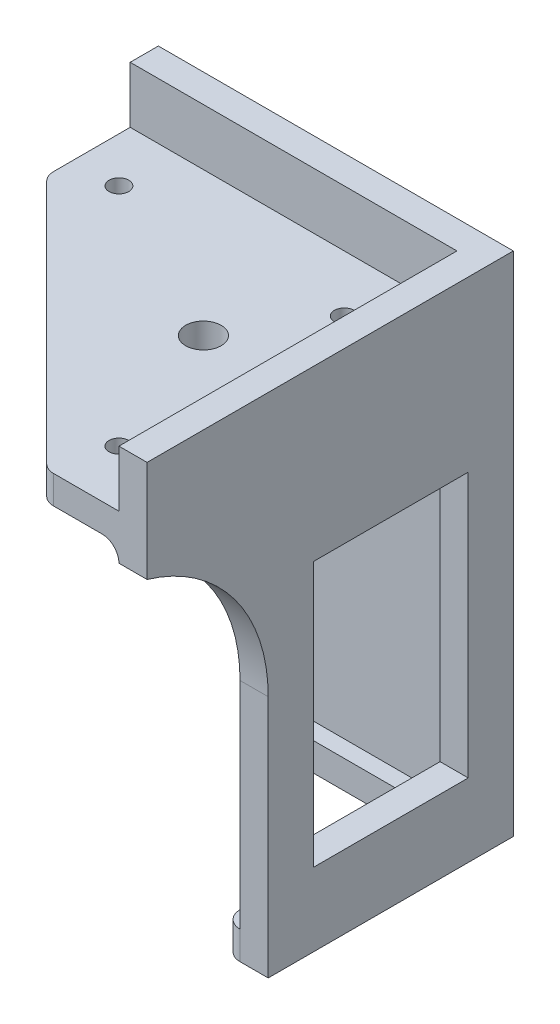
ISO-10303-21;
HEADER;
FILE_DESCRIPTION(('STEP AP214'),'2;1');
FILE_NAME('part.step','',(''),(''),'','','');
FILE_SCHEMA(('AUTOMOTIVE_DESIGN { 1 0 10303 214 1 1 1 1 }'));
ENDSEC;
DATA;
#1=APPLICATION_CONTEXT('core data for automotive mechanical design processes');
#2=APPLICATION_PROTOCOL_DEFINITION('international standard','automotive_design',2000,#1);
#3=PRODUCT_CONTEXT('',#1,'mechanical');
#4=PRODUCT('Part','Part','',(#3));
#5=PRODUCT_RELATED_PRODUCT_CATEGORY('part','',(#4));
#6=PRODUCT_DEFINITION_FORMATION('','',#4);
#7=PRODUCT_DEFINITION_CONTEXT('part definition',#1,'design');
#8=PRODUCT_DEFINITION('design','',#6,#7);
#9=PRODUCT_DEFINITION_SHAPE('','',#8);
#10=(LENGTH_UNIT() NAMED_UNIT(*) SI_UNIT(.MILLI.,.METRE.));
#11=(NAMED_UNIT(*) PLANE_ANGLE_UNIT() SI_UNIT($,.RADIAN.));
#12=(NAMED_UNIT(*) SI_UNIT($,.STERADIAN.) SOLID_ANGLE_UNIT());
#13=UNCERTAINTY_MEASURE_WITH_UNIT(LENGTH_MEASURE(1.E-05),#10,'distance_accuracy_value','');
#14=(GEOMETRIC_REPRESENTATION_CONTEXT(3) GLOBAL_UNCERTAINTY_ASSIGNED_CONTEXT((#13)) GLOBAL_UNIT_ASSIGNED_CONTEXT((#10,
#11,#12)) REPRESENTATION_CONTEXT('',''));
#15=CARTESIAN_POINT('',(0.,0.,0.));
#16=DIRECTION('',(0.,0.,1.));
#17=DIRECTION('',(1.,0.,0.));
#18=AXIS2_PLACEMENT_3D('',#15,#16,#17);
#19=CARTESIAN_POINT('',(-63.,-48.,5.));
#20=DIRECTION('',(0.,0.,1.));
#21=DIRECTION('',(1.,0.,0.));
#22=AXIS2_PLACEMENT_3D('',#19,#20,#21);
#23=PLANE('',#22);
#24=DIRECTION('',(0.,-1.,0.));
#25=VECTOR('',#24,1.);
#26=CARTESIAN_POINT('',(-7.99999999999996,-48.,5.));
#27=LINE('',#26,#25);
#28=CARTESIAN_POINT('',(-7.99999999999996,-85.,5.));
#29=VERTEX_POINT('',#28);
#30=CARTESIAN_POINT('',(-7.99999999999997,-18.,5.));
#31=VERTEX_POINT('',#30);
#32=EDGE_CURVE('E390',#29,#31,#27,.F.);
#33=ORIENTED_EDGE('',*,*,#32,.T.);
#34=DIRECTION('',(1.,0.,0.));
#35=VECTOR('',#34,1.);
#36=CARTESIAN_POINT('',(-63.,-18.,5.));
#37=LINE('',#36,#35);
#38=CARTESIAN_POINT('',(-63.,-18.,5.));
#39=VERTEX_POINT('',#38);
#40=EDGE_CURVE('E392',#31,#39,#37,.F.);
#41=ORIENTED_EDGE('',*,*,#40,.T.);
#42=CARTESIAN_POINT('',(-63.,-48.,5.));
#43=DIRECTION('',(0.,0.,-1.));
#44=DIRECTION('',(1.,0.,0.));
#45=AXIS2_PLACEMENT_3D('',#42,#43,#44);
#46=CIRCLE('',#45,30.);
#47=CARTESIAN_POINT('',(-33.,-48.,5.));
#48=VERTEX_POINT('',#47);
#49=EDGE_CURVE('E427',#39,#48,#46,.T.);
#50=ORIENTED_EDGE('',*,*,#49,.T.);
#51=DIRECTION('',(0.,-1.,0.));
#52=VECTOR('',#51,1.);
#53=CARTESIAN_POINT('',(-33.,-90.,5.));
#54=LINE('',#53,#52);
#55=CARTESIAN_POINT('',(-33.,-85.,5.));
#56=VERTEX_POINT('',#55);
#57=EDGE_CURVE('E438',#48,#56,#54,.T.);
#58=ORIENTED_EDGE('',*,*,#57,.T.);
#59=DIRECTION('',(1.,0.,0.));
#60=VECTOR('',#59,1.);
#61=CARTESIAN_POINT('',(-33.,-85.,5.));
#62=LINE('',#61,#60);
#63=EDGE_CURVE('E287',#56,#29,#62,.T.);
#64=ORIENTED_EDGE('',*,*,#63,.T.);
#65=EDGE_LOOP('',(#33,#41,#50,#58,#64));
#66=FACE_BOUND('',#65,.T.);
#67=ADVANCED_FACE('F33',(#66),#23,.T.);
#68=DIRECTION('',(0.,-1.,0.));
#69=VECTOR('',#68,1.);
#70=CARTESIAN_POINT('',(-63.,-18.,5.));
#71=LINE('',#70,#69);
#72=CARTESIAN_POINT('',(-63.,0.,5.));
#73=VERTEX_POINT('',#72);
#74=CARTESIAN_POINT('',(-63.,-10.,5.));
#75=VERTEX_POINT('',#74);
#76=EDGE_CURVE('E332',#73,#75,#71,.T.);
#77=ORIENTED_EDGE('',*,*,#76,.T.);
#78=DIRECTION('',(-1.,0.,0.));
#79=VECTOR('',#78,1.);
#80=CARTESIAN_POINT('',(-4.99999999999996,-10.,5.));
#81=LINE('',#80,#79);
#82=CARTESIAN_POINT('',(-4.99999999999996,-10.,5.));
#83=VERTEX_POINT('',#82);
#84=EDGE_CURVE('E269',#83,#75,#81,.T.);
#85=ORIENTED_EDGE('',*,*,#84,.F.);
#86=DIRECTION('',(0.,-1.,0.));
#87=VECTOR('',#86,1.);
#88=CARTESIAN_POINT('',(-4.99999999999997,0.,5.));
#89=LINE('',#88,#87);
#90=CARTESIAN_POINT('',(-4.99999999999996,0.,5.));
#91=VERTEX_POINT('',#90);
#92=EDGE_CURVE('E311',#91,#83,#89,.T.);
#93=ORIENTED_EDGE('',*,*,#92,.F.);
#94=DIRECTION('',(-1.,0.,0.));
#95=VECTOR('',#94,1.);
#96=CARTESIAN_POINT('',(-63.,0.,5.));
#97=LINE('',#96,#95);
#98=EDGE_CURVE('E338',#91,#73,#97,.T.);
#99=ORIENTED_EDGE('',*,*,#98,.T.);
#100=EDGE_LOOP('',(#77,#85,#93,#99));
#101=FACE_BOUND('',#100,.T.);
#102=ADVANCED_FACE('F473',(#101),#23,.T.);
#103=CARTESIAN_POINT('',(-4.99999999999997,0.,65.));
#104=DIRECTION('',(1.,0.,0.));
#105=DIRECTION('',(0.,1.,0.));
#106=AXIS2_PLACEMENT_3D('',#103,#104,#105);
#107=PLANE('',#106);
#108=DIRECTION('',(0.,-1.,0.));
#109=VECTOR('',#108,1.);
#110=CARTESIAN_POINT('',(-4.99999999999997,0.,8.));
#111=LINE('',#110,#109);
#112=CARTESIAN_POINT('',(-4.99999999999997,-18.,8.));
#113=VERTEX_POINT('',#112);
#114=CARTESIAN_POINT('',(-4.99999999999997,-30.,8.));
#115=VERTEX_POINT('',#114);
#116=EDGE_CURVE('E395',#113,#115,#111,.T.);
#117=ORIENTED_EDGE('',*,*,#116,.T.);
#118=DIRECTION('',(0.,0.,-1.));
#119=VECTOR('',#118,1.);
#120=CARTESIAN_POINT('',(-4.99999999999996,-30.,35.5));
#121=LINE('',#120,#119);
#122=CARTESIAN_POINT('',(-4.99999999999996,-30.,35.5));
#123=VERTEX_POINT('',#122);
#124=EDGE_CURVE('E523',#123,#115,#121,.T.);
#125=ORIENTED_EDGE('',*,*,#124,.F.);
#126=DIRECTION('',(0.,1.,0.));
#127=VECTOR('',#126,1.);
#128=CARTESIAN_POINT('',(-4.99999999999996,-30.,35.5));
#129=LINE('',#128,#127);
#130=CARTESIAN_POINT('',(-4.99999999999996,-77.,35.5));
#131=VERTEX_POINT('',#130);
#132=EDGE_CURVE('E241',#131,#123,#129,.T.);
#133=ORIENTED_EDGE('',*,*,#132,.F.);
#134=DIRECTION('',(0.,0.,1.));
#135=VECTOR('',#134,1.);
#136=CARTESIAN_POINT('',(-4.99999999999996,-77.,35.5));
#137=LINE('',#136,#135);
#138=CARTESIAN_POINT('',(-4.99999999999996,-77.,8.));
#139=VERTEX_POINT('',#138);
#140=EDGE_CURVE('E238',#139,#131,#137,.T.);
#141=ORIENTED_EDGE('',*,*,#140,.F.);
#142=CARTESIAN_POINT('',(-4.99999999999996,-85.,8.));
#143=VERTEX_POINT('',#142);
#144=EDGE_CURVE('E394',#139,#143,#111,.T.);
#145=ORIENTED_EDGE('',*,*,#144,.T.);
#146=DIRECTION('',(0.,0.,1.));
#147=VECTOR('',#146,1.);
#148=CARTESIAN_POINT('',(-4.99999999999996,-85.,5.));
#149=LINE('',#148,#147);
#150=CARTESIAN_POINT('',(-4.99999999999996,-85.,43.5));
#151=VERTEX_POINT('',#150);
#152=EDGE_CURVE('E290',#143,#151,#149,.T.);
#153=ORIENTED_EDGE('',*,*,#152,.T.);
#154=DIRECTION('',(0.,-1.,0.));
#155=VECTOR('',#154,1.);
#156=CARTESIAN_POINT('',(-4.99999999999996,-90.,43.5));
#157=LINE('',#156,#155);
#158=CARTESIAN_POINT('',(-4.99999999999997,-46.7706447616316,43.5));
#159=VERTEX_POINT('',#158);
#160=EDGE_CURVE('E305',#159,#151,#157,.T.);
#161=ORIENTED_EDGE('',*,*,#160,.F.);
#162=CARTESIAN_POINT('',(-4.99999999999998,-46.7706447616316,73.5));
#163=DIRECTION('',(1.,0.,0.));
#164=DIRECTION('',(0.,1.,0.));
#165=AXIS2_PLACEMENT_3D('',#162,#163,#164);
#166=CIRCLE('',#165,30.);
#167=CARTESIAN_POINT('',(-4.99999999999998,-18.,65.));
#168=VERTEX_POINT('',#167);
#169=EDGE_CURVE('E308',#168,#159,#166,.F.);
#170=ORIENTED_EDGE('',*,*,#169,.F.);
#171=DIRECTION('',(0.,0.,-1.));
#172=VECTOR('',#171,1.);
#173=CARTESIAN_POINT('',(-4.99999999999997,-18.,5.));
#174=LINE('',#173,#172);
#175=EDGE_CURVE('E398',#168,#113,#174,.T.);
#176=ORIENTED_EDGE('',*,*,#175,.T.);
#177=EDGE_LOOP('',(#117,#125,#133,#141,#145,#153,#161,#170,#176));
#178=FACE_BOUND('',#177,.T.);
#179=ADVANCED_FACE('F521',(#178),#107,.F.);
#180=DIRECTION('',(0.,0.,-1.));
#181=VECTOR('',#180,1.);
#182=CARTESIAN_POINT('',(-4.99999999999996,-10.,123.215118311312));
#183=LINE('',#182,#181);
#184=CARTESIAN_POINT('',(-4.99999999999996,-10.,65.));
#185=VERTEX_POINT('',#184);
#186=EDGE_CURVE('E284',#185,#83,#183,.T.);
#187=ORIENTED_EDGE('',*,*,#186,.F.);
#188=DIRECTION('',(0.,-1.,0.));
#189=VECTOR('',#188,1.);
#190=CARTESIAN_POINT('',(-4.99999999999997,0.,65.));
#191=LINE('',#190,#189);
#192=CARTESIAN_POINT('',(-4.99999999999997,0.,65.));
#193=VERTEX_POINT('',#192);
#194=EDGE_CURVE('E326',#193,#185,#191,.T.);
#195=ORIENTED_EDGE('',*,*,#194,.F.);
#196=DIRECTION('',(0.,0.,-1.));
#197=VECTOR('',#196,1.);
#198=CARTESIAN_POINT('',(-4.99999999999997,0.,65.));
#199=LINE('',#198,#197);
#200=EDGE_CURVE('E329',#193,#91,#199,.T.);
#201=ORIENTED_EDGE('',*,*,#200,.T.);
#202=ORIENTED_EDGE('',*,*,#92,.T.);
#203=EDGE_LOOP('',(#187,#195,#201,#202));
#204=FACE_BOUND('',#203,.T.);
#205=ADVANCED_FACE('F487',(#204),#107,.F.);
#206=CARTESIAN_POINT('',(-63.,-18.,5.));
#207=DIRECTION('',(1.,0.,0.));
#208=DIRECTION('',(0.,1.,0.));
#209=AXIS2_PLACEMENT_3D('',#206,#207,#208);
#210=PLANE('',#209);
#211=DIRECTION('',(0.,0.,-1.));
#212=VECTOR('',#211,1.);
#213=CARTESIAN_POINT('',(-63.,-15.,123.215118311312));
#214=LINE('',#213,#212);
#215=CARTESIAN_POINT('',(-63.,-15.,18.575));
#216=VERTEX_POINT('',#215);
#217=CARTESIAN_POINT('',(-63.,-15.,8.00000000000004));
#218=VERTEX_POINT('',#217);
#219=EDGE_CURVE('E279',#216,#218,#214,.T.);
#220=ORIENTED_EDGE('',*,*,#219,.F.);
#221=DIRECTION('',(0.,1.,0.));
#222=VECTOR('',#221,1.);
#223=CARTESIAN_POINT('',(-63.,-18.,18.575));
#224=LINE('',#223,#222);
#225=CARTESIAN_POINT('',(-63.,-10.,18.575));
#226=VERTEX_POINT('',#225);
#227=EDGE_CURVE('E382',#216,#226,#224,.T.);
#228=ORIENTED_EDGE('',*,*,#227,.T.);
#229=DIRECTION('',(0.,0.,-1.));
#230=VECTOR('',#229,1.);
#231=CARTESIAN_POINT('',(-63.,-10.,123.215118311312));
#232=LINE('',#231,#230);
#233=EDGE_CURVE('E282',#226,#75,#232,.T.);
#234=ORIENTED_EDGE('',*,*,#233,.T.);
#235=ORIENTED_EDGE('',*,*,#76,.F.);
#236=DIRECTION('',(0.,0.,-1.));
#237=VECTOR('',#236,1.);
#238=CARTESIAN_POINT('',(-63.,0.,5.));
#239=LINE('',#238,#237);
#240=CARTESIAN_POINT('',(-63.,0.,0.));
#241=VERTEX_POINT('',#240);
#242=EDGE_CURVE('E452',#73,#241,#239,.T.);
#243=ORIENTED_EDGE('',*,*,#242,.T.);
#244=DIRECTION('',(0.,-1.,0.));
#245=VECTOR('',#244,1.);
#246=CARTESIAN_POINT('',(-63.,-18.,0.));
#247=LINE('',#246,#245);
#248=CARTESIAN_POINT('',(-63.,-18.,0.));
#249=VERTEX_POINT('',#248);
#250=EDGE_CURVE('E343',#241,#249,#247,.T.);
#251=ORIENTED_EDGE('',*,*,#250,.T.);
#252=DIRECTION('',(0.,0.,-1.));
#253=VECTOR('',#252,1.);
#254=CARTESIAN_POINT('',(-63.,-18.,5.));
#255=LINE('',#254,#253);
#256=EDGE_CURVE('E350',#39,#249,#255,.T.);
#257=ORIENTED_EDGE('',*,*,#256,.F.);
#258=CARTESIAN_POINT('',(-63.,-18.,8.00000000000001));
#259=DIRECTION('',(1.,0.,0.));
#260=DIRECTION('',(0.,1.,0.));
#261=AXIS2_PLACEMENT_3D('',#258,#259,#260);
#262=CIRCLE('',#261,3.);
#263=EDGE_CURVE('E42',#39,#218,#262,.T.);
#264=ORIENTED_EDGE('',*,*,#263,.T.);
#265=EDGE_LOOP('',(#220,#228,#234,#235,#243,#251,#257,#264));
#266=FACE_BOUND('',#265,.T.);
#267=ADVANCED_FACE('F440',(#266),#210,.F.);
#268=CARTESIAN_POINT('',(-63.,-48.,5.));
#269=DIRECTION('',(0.,0.,-1.));
#270=DIRECTION('',(-1.,0.,0.));
#271=AXIS2_PLACEMENT_3D('',#268,#269,#270);
#272=CYLINDRICAL_SURFACE('',#271,30.);
#273=CARTESIAN_POINT('',(-63.,-48.,0.));
#274=DIRECTION('',(0.,0.,-1.));
#275=DIRECTION('',(1.,0.,0.));
#276=AXIS2_PLACEMENT_3D('',#273,#274,#275);
#277=CIRCLE('',#276,30.);
#278=CARTESIAN_POINT('',(-33.,-48.,0.));
#279=VERTEX_POINT('',#278);
#280=EDGE_CURVE('E464',#249,#279,#277,.T.);
#281=ORIENTED_EDGE('',*,*,#280,.T.);
#282=DIRECTION('',(0.,0.,-1.));
#283=VECTOR('',#282,1.);
#284=CARTESIAN_POINT('',(-33.,-48.,5.));
#285=LINE('',#284,#283);
#286=EDGE_CURVE('E436',#48,#279,#285,.T.);
#287=ORIENTED_EDGE('',*,*,#286,.F.);
#288=ORIENTED_EDGE('',*,*,#49,.F.);
#289=ORIENTED_EDGE('',*,*,#256,.T.);
#290=EDGE_LOOP('',(#281,#287,#288,#289));
#291=FACE_BOUND('',#290,.T.);
#292=ADVANCED_FACE('F433',(#291),#272,.F.);
#293=CARTESIAN_POINT('',(-33.,-90.,5.));
#294=DIRECTION('',(1.,0.,0.));
#295=DIRECTION('',(0.,0.,-1.));
#296=AXIS2_PLACEMENT_3D('',#293,#294,#295);
#297=PLANE('',#296);
#298=DIRECTION('',(0.,0.,-1.));
#299=VECTOR('',#298,1.);
#300=CARTESIAN_POINT('',(-33.,-90.,5.));
#301=LINE('',#300,#299);
#302=CARTESIAN_POINT('',(-33.,-90.,5.));
#303=VERTEX_POINT('',#302);
#304=CARTESIAN_POINT('',(-33.,-90.,0.));
#305=VERTEX_POINT('',#304);
#306=EDGE_CURVE('E443',#303,#305,#301,.T.);
#307=ORIENTED_EDGE('',*,*,#306,.F.);
#308=DIRECTION('',(0.,-1.,0.));
#309=VECTOR('',#308,1.);
#310=CARTESIAN_POINT('',(-33.,-85.,5.));
#311=LINE('',#310,#309);
#312=EDGE_CURVE('E354',#303,#56,#311,.F.);
#313=ORIENTED_EDGE('',*,*,#312,.T.);
#314=ORIENTED_EDGE('',*,*,#57,.F.);
#315=ORIENTED_EDGE('',*,*,#286,.T.);
#316=DIRECTION('',(0.,-1.,0.));
#317=VECTOR('',#316,1.);
#318=CARTESIAN_POINT('',(-33.,-90.,0.));
#319=LINE('',#318,#317);
#320=EDGE_CURVE('E461',#279,#305,#319,.T.);
#321=ORIENTED_EDGE('',*,*,#320,.T.);
#322=EDGE_LOOP('',(#307,#313,#314,#315,#321));
#323=FACE_BOUND('',#322,.T.);
#324=ADVANCED_FACE('F506',(#323),#297,.F.);
#325=CARTESIAN_POINT('',(0.,-90.,5.));
#326=DIRECTION('',(0.,1.,0.));
#327=DIRECTION('',(0.,0.,1.));
#328=AXIS2_PLACEMENT_3D('',#325,#326,#327);
#329=PLANE('',#328);
#330=DIRECTION('',(-1.,0.,0.));
#331=VECTOR('',#330,1.);
#332=CARTESIAN_POINT('',(-33.,-90.,8.));
#333=LINE('',#332,#331);
#334=CARTESIAN_POINT('',(-7.99999999999996,-90.,8.));
#335=VERTEX_POINT('',#334);
#336=CARTESIAN_POINT('',(-30.,-90.,8.));
#337=VERTEX_POINT('',#336);
#338=EDGE_CURVE('E291',#335,#337,#333,.T.);
#339=ORIENTED_EDGE('',*,*,#338,.T.);
#340=CARTESIAN_POINT('',(-30.,-90.,5.));
#341=DIRECTION('',(0.,1.,0.));
#342=DIRECTION('',(0.,0.,1.));
#343=AXIS2_PLACEMENT_3D('',#340,#341,#342);
#344=CIRCLE('',#343,3.);
#345=EDGE_CURVE('E352',#337,#303,#344,.F.);
#346=ORIENTED_EDGE('',*,*,#345,.T.);
#347=ORIENTED_EDGE('',*,*,#306,.T.);
#348=DIRECTION('',(1.,0.,0.));
#349=VECTOR('',#348,1.);
#350=CARTESIAN_POINT('',(0.,-90.,0.));
#351=LINE('',#350,#349);
#352=CARTESIAN_POINT('',(0.,-90.,0.));
#353=VERTEX_POINT('',#352);
#354=EDGE_CURVE('E458',#305,#353,#351,.T.);
#355=ORIENTED_EDGE('',*,*,#354,.T.);
#356=DIRECTION('',(0.,0.,-1.));
#357=VECTOR('',#356,1.);
#358=CARTESIAN_POINT('',(0.,-90.,5.));
#359=LINE('',#358,#357);
#360=CARTESIAN_POINT('',(0.,-90.,43.5));
#361=VERTEX_POINT('',#360);
#362=EDGE_CURVE('E447',#361,#353,#359,.T.);
#363=ORIENTED_EDGE('',*,*,#362,.F.);
#364=DIRECTION('',(1.,0.,0.));
#365=VECTOR('',#364,1.);
#366=CARTESIAN_POINT('',(-80.1415331225015,-90.,43.5));
#367=LINE('',#366,#365);
#368=CARTESIAN_POINT('',(-4.99999999999996,-90.,43.5));
#369=VERTEX_POINT('',#368);
#370=EDGE_CURVE('E316',#369,#361,#367,.T.);
#371=ORIENTED_EDGE('',*,*,#370,.F.);
#372=CARTESIAN_POINT('',(-4.99999999999996,-90.,40.5));
#373=DIRECTION('',(0.,1.,0.));
#374=DIRECTION('',(0.,0.,1.));
#375=AXIS2_PLACEMENT_3D('',#372,#373,#374);
#376=CIRCLE('',#375,3.);
#377=CARTESIAN_POINT('',(-7.99999999999996,-90.,40.5));
#378=VERTEX_POINT('',#377);
#379=EDGE_CURVE('E349',#369,#378,#376,.F.);
#380=ORIENTED_EDGE('',*,*,#379,.T.);
#381=DIRECTION('',(0.,0.,-1.));
#382=VECTOR('',#381,1.);
#383=CARTESIAN_POINT('',(-7.99999999999996,-90.,8.));
#384=LINE('',#383,#382);
#385=EDGE_CURVE('E275',#378,#335,#384,.T.);
#386=ORIENTED_EDGE('',*,*,#385,.T.);
#387=EDGE_LOOP('',(#339,#346,#347,#355,#363,#371,#380,#386));
#388=FACE_BOUND('',#387,.T.);
#389=ADVANCED_FACE('F534',(#388),#329,.F.);
#390=CARTESIAN_POINT('',(0.,0.,5.));
#391=DIRECTION('',(-1.,0.,0.));
#392=DIRECTION('',(0.,-1.,0.));
#393=AXIS2_PLACEMENT_3D('',#390,#391,#392);
#394=PLANE('',#393);
#395=DIRECTION('',(0.,0.,-1.));
#396=VECTOR('',#395,1.);
#397=CARTESIAN_POINT('',(0.,-77.,35.5));
#398=LINE('',#397,#396);
#399=CARTESIAN_POINT('',(0.,-77.,35.5));
#400=VERTEX_POINT('',#399);
#401=CARTESIAN_POINT('',(0.,-77.,8.));
#402=VERTEX_POINT('',#401);
#403=EDGE_CURVE('E222',#400,#402,#398,.T.);
#404=ORIENTED_EDGE('',*,*,#403,.F.);
#405=DIRECTION('',(0.,-1.,0.));
#406=VECTOR('',#405,1.);
#407=CARTESIAN_POINT('',(0.,-30.,35.5));
#408=LINE('',#407,#406);
#409=CARTESIAN_POINT('',(0.,-30.,35.5));
#410=VERTEX_POINT('',#409);
#411=EDGE_CURVE('E50',#410,#400,#408,.T.);
#412=ORIENTED_EDGE('',*,*,#411,.F.);
#413=DIRECTION('',(0.,0.,1.));
#414=VECTOR('',#413,1.);
#415=CARTESIAN_POINT('',(0.,-30.,35.5));
#416=LINE('',#415,#414);
#417=CARTESIAN_POINT('',(0.,-30.,8.00000000000001));
#418=VERTEX_POINT('',#417);
#419=EDGE_CURVE('E229',#418,#410,#416,.T.);
#420=ORIENTED_EDGE('',*,*,#419,.F.);
#421=DIRECTION('',(0.,1.,0.));
#422=VECTOR('',#421,1.);
#423=CARTESIAN_POINT('',(0.,-30.,8.00000000000001));
#424=LINE('',#423,#422);
#425=EDGE_CURVE('E213',#402,#418,#424,.T.);
#426=ORIENTED_EDGE('',*,*,#425,.F.);
#427=EDGE_LOOP('',(#404,#412,#420,#426));
#428=FACE_BOUND('',#427,.T.);
#429=DIRECTION('',(0.,1.,0.));
#430=VECTOR('',#429,1.);
#431=CARTESIAN_POINT('',(0.,0.,65.));
#432=LINE('',#431,#430);
#433=CARTESIAN_POINT('',(0.,-18.,65.));
#434=VERTEX_POINT('',#433);
#435=CARTESIAN_POINT('',(0.,0.,65.));
#436=VERTEX_POINT('',#435);
#437=EDGE_CURVE('E322',#434,#436,#432,.T.);
#438=ORIENTED_EDGE('',*,*,#437,.F.);
#439=CARTESIAN_POINT('',(0.,-46.7706447616316,73.5));
#440=DIRECTION('',(1.,0.,0.));
#441=DIRECTION('',(0.,1.,0.));
#442=AXIS2_PLACEMENT_3D('',#439,#440,#441);
#443=CIRCLE('',#442,30.);
#444=CARTESIAN_POINT('',(0.,-46.7706447616316,43.5));
#445=VERTEX_POINT('',#444);
#446=EDGE_CURVE('E314',#445,#434,#443,.T.);
#447=ORIENTED_EDGE('',*,*,#446,.F.);
#448=DIRECTION('',(0.,1.,0.));
#449=VECTOR('',#448,1.);
#450=CARTESIAN_POINT('',(0.,-90.,43.5));
#451=LINE('',#450,#449);
#452=EDGE_CURVE('E304',#361,#445,#451,.T.);
#453=ORIENTED_EDGE('',*,*,#452,.F.);
#454=ORIENTED_EDGE('',*,*,#362,.T.);
#455=DIRECTION('',(0.,1.,0.));
#456=VECTOR('',#455,1.);
#457=CARTESIAN_POINT('',(0.,0.,0.));
#458=LINE('',#457,#456);
#459=CARTESIAN_POINT('',(0.,0.,0.));
#460=VERTEX_POINT('',#459);
#461=EDGE_CURVE('E456',#353,#460,#458,.T.);
#462=ORIENTED_EDGE('',*,*,#461,.T.);
#463=DIRECTION('',(0.,0.,-1.));
#464=VECTOR('',#463,1.);
#465=CARTESIAN_POINT('',(0.,0.,5.));
#466=LINE('',#465,#464);
#467=EDGE_CURVE('E449',#436,#460,#466,.T.);
#468=ORIENTED_EDGE('',*,*,#467,.F.);
#469=EDGE_LOOP('',(#438,#447,#453,#454,#462,#468));
#470=FACE_BOUND('',#469,.T.);
#471=ADVANCED_FACE('F226',(#428,#470),#394,.F.);
#472=CARTESIAN_POINT('',(-63.,0.,5.));
#473=DIRECTION('',(0.,-1.,0.));
#474=DIRECTION('',(0.,0.,-1.));
#475=AXIS2_PLACEMENT_3D('',#472,#473,#474);
#476=PLANE('',#475);
#477=DIRECTION('',(-1.,0.,0.));
#478=VECTOR('',#477,1.);
#479=CARTESIAN_POINT('',(-63.,0.,0.));
#480=LINE('',#479,#478);
#481=EDGE_CURVE('E454',#460,#241,#480,.T.);
#482=ORIENTED_EDGE('',*,*,#481,.T.);
#483=ORIENTED_EDGE('',*,*,#242,.F.);
#484=ORIENTED_EDGE('',*,*,#98,.F.);
#485=ORIENTED_EDGE('',*,*,#200,.F.);
#486=DIRECTION('',(-1.,0.,0.));
#487=VECTOR('',#486,1.);
#488=CARTESIAN_POINT('',(0.,0.,65.));
#489=LINE('',#488,#487);
#490=EDGE_CURVE('E324',#436,#193,#489,.T.);
#491=ORIENTED_EDGE('',*,*,#490,.F.);
#492=ORIENTED_EDGE('',*,*,#467,.T.);
#493=EDGE_LOOP('',(#482,#483,#484,#485,#491,#492));
#494=FACE_BOUND('',#493,.T.);
#495=ADVANCED_FACE('F478',(#494),#476,.F.);
#496=CARTESIAN_POINT('',(-63.,-48.,0.));
#497=DIRECTION('',(0.,0.,1.));
#498=DIRECTION('',(1.,0.,0.));
#499=AXIS2_PLACEMENT_3D('',#496,#497,#498);
#500=PLANE('',#499);
#501=ORIENTED_EDGE('',*,*,#250,.F.);
#502=ORIENTED_EDGE('',*,*,#481,.F.);
#503=ORIENTED_EDGE('',*,*,#461,.F.);
#504=ORIENTED_EDGE('',*,*,#354,.F.);
#505=ORIENTED_EDGE('',*,*,#320,.F.);
#506=ORIENTED_EDGE('',*,*,#280,.F.);
#507=EDGE_LOOP('',(#501,#502,#503,#504,#505,#506));
#508=FACE_BOUND('',#507,.T.);
#509=ADVANCED_FACE('F502',(#508),#500,.F.);
#510=CARTESIAN_POINT('',(0.,0.,65.));
#511=DIRECTION('',(0.,0.,-1.));
#512=DIRECTION('',(-1.,0.,0.));
#513=AXIS2_PLACEMENT_3D('',#510,#511,#512);
#514=PLANE('',#513);
#515=DIRECTION('',(1.,0.,0.));
#516=VECTOR('',#515,1.);
#517=CARTESIAN_POINT('',(-4.99999999999996,-10.,65.));
#518=LINE('',#517,#516);
#519=CARTESIAN_POINT('',(-16.5750000000005,-10.,65.));
#520=VERTEX_POINT('',#519);
#521=EDGE_CURVE('E273',#520,#185,#518,.T.);
#522=ORIENTED_EDGE('',*,*,#521,.F.);
#523=DIRECTION('',(0.,1.,0.));
#524=VECTOR('',#523,1.);
#525=CARTESIAN_POINT('',(-16.5750000000005,0.,65.));
#526=LINE('',#525,#524);
#527=CARTESIAN_POINT('',(-16.5750000000005,-15.,65.));
#528=VERTEX_POINT('',#527);
#529=EDGE_CURVE('E375',#520,#528,#526,.F.);
#530=ORIENTED_EDGE('',*,*,#529,.T.);
#531=DIRECTION('',(-1.,0.,0.));
#532=VECTOR('',#531,1.);
#533=CARTESIAN_POINT('',(-4.99999999999996,-15.,65.));
#534=LINE('',#533,#532);
#535=CARTESIAN_POINT('',(-7.99999999999997,-15.,65.));
#536=VERTEX_POINT('',#535);
#537=EDGE_CURVE('E276',#536,#528,#534,.T.);
#538=ORIENTED_EDGE('',*,*,#537,.F.);
#539=CARTESIAN_POINT('',(-7.99999999999997,-18.,65.));
#540=DIRECTION('',(0.,0.,-1.));
#541=DIRECTION('',(-1.,0.,0.));
#542=AXIS2_PLACEMENT_3D('',#539,#540,#541);
#543=CIRCLE('',#542,3.);
#544=EDGE_CURVE('E11',#536,#168,#543,.T.);
#545=ORIENTED_EDGE('',*,*,#544,.T.);
#546=DIRECTION('',(1.,0.,0.));
#547=VECTOR('',#546,1.);
#548=CARTESIAN_POINT('',(-80.1415331225015,-18.,65.));
#549=LINE('',#548,#547);
#550=EDGE_CURVE('E309',#168,#434,#549,.T.);
#551=ORIENTED_EDGE('',*,*,#550,.T.);
#552=ORIENTED_EDGE('',*,*,#437,.T.);
#553=ORIENTED_EDGE('',*,*,#490,.T.);
#554=ORIENTED_EDGE('',*,*,#194,.T.);
#555=EDGE_LOOP('',(#522,#530,#538,#545,#551,#552,#553,#554));
#556=FACE_BOUND('',#555,.T.);
#557=ADVANCED_FACE('F493',(#556),#514,.F.);
#558=CARTESIAN_POINT('',(-80.1415331225015,-46.7706447616316,73.5));
#559=DIRECTION('',(1.,0.,0.));
#560=DIRECTION('',(0.,1.,0.));
#561=AXIS2_PLACEMENT_3D('',#558,#559,#560);
#562=CYLINDRICAL_SURFACE('',#561,30.);
#563=ORIENTED_EDGE('',*,*,#169,.T.);
#564=DIRECTION('',(1.,0.,0.));
#565=VECTOR('',#564,1.);
#566=CARTESIAN_POINT('',(-80.1415331225015,-46.7706447616316,43.5));
#567=LINE('',#566,#565);
#568=EDGE_CURVE('E319',#159,#445,#567,.T.);
#569=ORIENTED_EDGE('',*,*,#568,.T.);
#570=ORIENTED_EDGE('',*,*,#446,.T.);
#571=ORIENTED_EDGE('',*,*,#550,.F.);
#572=EDGE_LOOP('',(#563,#569,#570,#571));
#573=FACE_BOUND('',#572,.T.);
#574=ADVANCED_FACE('F528',(#573),#562,.F.);
#575=CARTESIAN_POINT('',(-80.1415331225015,-90.,43.5));
#576=DIRECTION('',(0.,0.,-1.));
#577=DIRECTION('',(-1.,0.,0.));
#578=AXIS2_PLACEMENT_3D('',#575,#576,#577);
#579=PLANE('',#578);
#580=ORIENTED_EDGE('',*,*,#160,.T.);
#581=DIRECTION('',(0.,-1.,0.));
#582=VECTOR('',#581,1.);
#583=CARTESIAN_POINT('',(-4.99999999999996,-90.,43.5));
#584=LINE('',#583,#582);
#585=EDGE_CURVE('E361',#151,#369,#584,.T.);
#586=ORIENTED_EDGE('',*,*,#585,.T.);
#587=ORIENTED_EDGE('',*,*,#370,.T.);
#588=ORIENTED_EDGE('',*,*,#452,.T.);
#589=ORIENTED_EDGE('',*,*,#568,.F.);
#590=EDGE_LOOP('',(#580,#586,#587,#588,#589));
#591=FACE_BOUND('',#590,.T.);
#592=ADVANCED_FACE('F530',(#591),#579,.F.);
#593=CARTESIAN_POINT('',(-33.,-85.,8.));
#594=DIRECTION('',(0.,0.,1.));
#595=DIRECTION('',(1.,0.,0.));
#596=AXIS2_PLACEMENT_3D('',#593,#594,#595);
#597=PLANE('',#596);
#598=DIRECTION('',(-1.,0.,0.));
#599=VECTOR('',#598,1.);
#600=CARTESIAN_POINT('',(-33.,-85.,8.));
#601=LINE('',#600,#599);
#602=CARTESIAN_POINT('',(-7.99999999999996,-85.,8.));
#603=VERTEX_POINT('',#602);
#604=CARTESIAN_POINT('',(-30.,-85.,8.));
#605=VERTEX_POINT('',#604);
#606=EDGE_CURVE('E295',#603,#605,#601,.T.);
#607=ORIENTED_EDGE('',*,*,#606,.T.);
#608=DIRECTION('',(0.,-1.,0.));
#609=VECTOR('',#608,1.);
#610=CARTESIAN_POINT('',(-30.,-90.,8.));
#611=LINE('',#610,#609);
#612=EDGE_CURVE('E346',#605,#337,#611,.T.);
#613=ORIENTED_EDGE('',*,*,#612,.T.);
#614=ORIENTED_EDGE('',*,*,#338,.F.);
#615=DIRECTION('',(0.,-1.,0.));
#616=VECTOR('',#615,1.);
#617=CARTESIAN_POINT('',(-7.99999999999996,-85.,8.));
#618=LINE('',#617,#616);
#619=EDGE_CURVE('E298',#603,#335,#618,.T.);
#620=ORIENTED_EDGE('',*,*,#619,.F.);
#621=EDGE_LOOP('',(#607,#613,#614,#620));
#622=FACE_BOUND('',#621,.T.);
#623=ADVANCED_FACE('F539',(#622),#597,.T.);
#624=CARTESIAN_POINT('',(-7.99999999999996,-85.,8.));
#625=DIRECTION('',(-1.,0.,0.));
#626=DIRECTION('',(0.,-1.,0.));
#627=AXIS2_PLACEMENT_3D('',#624,#625,#626);
#628=PLANE('',#627);
#629=ORIENTED_EDGE('',*,*,#385,.F.);
#630=DIRECTION('',(0.,-1.,0.));
#631=VECTOR('',#630,1.);
#632=CARTESIAN_POINT('',(-7.99999999999996,-85.,40.5));
#633=LINE('',#632,#631);
#634=CARTESIAN_POINT('',(-7.99999999999996,-85.,40.5));
#635=VERTEX_POINT('',#634);
#636=EDGE_CURVE('E364',#378,#635,#633,.F.);
#637=ORIENTED_EDGE('',*,*,#636,.T.);
#638=DIRECTION('',(0.,0.,-1.));
#639=VECTOR('',#638,1.);
#640=CARTESIAN_POINT('',(-7.99999999999996,-85.,8.));
#641=LINE('',#640,#639);
#642=EDGE_CURVE('E293',#635,#603,#641,.T.);
#643=ORIENTED_EDGE('',*,*,#642,.T.);
#644=ORIENTED_EDGE('',*,*,#619,.T.);
#645=EDGE_LOOP('',(#629,#637,#643,#644));
#646=FACE_BOUND('',#645,.T.);
#647=ADVANCED_FACE('F548',(#646),#628,.T.);
#648=CARTESIAN_POINT('',(0.,-85.,0.));
#649=DIRECTION('',(0.,1.,0.));
#650=DIRECTION('',(0.,0.,1.));
#651=AXIS2_PLACEMENT_3D('',#648,#649,#650);
#652=PLANE('',#651);
#653=ORIENTED_EDGE('',*,*,#152,.F.);
#654=CARTESIAN_POINT('',(-7.99999999999996,-85.,8.));
#655=DIRECTION('',(0.,1.,0.));
#656=DIRECTION('',(0.,0.,1.));
#657=AXIS2_PLACEMENT_3D('',#654,#655,#656);
#658=CIRCLE('',#657,3.);
#659=EDGE_CURVE('E400',#143,#29,#658,.T.);
#660=ORIENTED_EDGE('',*,*,#659,.T.);
#661=ORIENTED_EDGE('',*,*,#63,.F.);
#662=CARTESIAN_POINT('',(-30.,-85.,5.));
#663=DIRECTION('',(0.,1.,0.));
#664=DIRECTION('',(0.,0.,1.));
#665=AXIS2_PLACEMENT_3D('',#662,#663,#664);
#666=CIRCLE('',#665,3.);
#667=EDGE_CURVE('E359',#56,#605,#666,.T.);
#668=ORIENTED_EDGE('',*,*,#667,.T.);
#669=ORIENTED_EDGE('',*,*,#606,.F.);
#670=ORIENTED_EDGE('',*,*,#642,.F.);
#671=CARTESIAN_POINT('',(-4.99999999999996,-85.,40.5));
#672=DIRECTION('',(0.,1.,0.));
#673=DIRECTION('',(0.,0.,1.));
#674=AXIS2_PLACEMENT_3D('',#671,#672,#673);
#675=CIRCLE('',#674,3.);
#676=EDGE_CURVE('E356',#635,#151,#675,.T.);
#677=ORIENTED_EDGE('',*,*,#676,.T.);
#678=EDGE_LOOP('',(#653,#660,#661,#668,#669,#670,#677));
#679=FACE_BOUND('',#678,.T.);
#680=ADVANCED_FACE('F512',(#679),#652,.T.);
#681=CARTESIAN_POINT('',(-30.,-85.,5.));
#682=DIRECTION('',(0.,1.,0.));
#683=DIRECTION('',(0.,0.,1.));
#684=AXIS2_PLACEMENT_3D('',#681,#682,#683);
#685=CYLINDRICAL_SURFACE('',#684,3.);
#686=ORIENTED_EDGE('',*,*,#667,.F.);
#687=ORIENTED_EDGE('',*,*,#312,.F.);
#688=ORIENTED_EDGE('',*,*,#345,.F.);
#689=ORIENTED_EDGE('',*,*,#612,.F.);
#690=EDGE_LOOP('',(#686,#687,#688,#689));
#691=FACE_BOUND('',#690,.T.);
#692=ADVANCED_FACE('F537',(#691),#685,.T.);
#693=CARTESIAN_POINT('',(-4.99999999999996,-90.,40.5));
#694=DIRECTION('',(0.,1.,0.));
#695=DIRECTION('',(-1.,0.,0.));
#696=AXIS2_PLACEMENT_3D('',#693,#694,#695);
#697=CYLINDRICAL_SURFACE('',#696,3.);
#698=ORIENTED_EDGE('',*,*,#676,.F.);
#699=ORIENTED_EDGE('',*,*,#636,.F.);
#700=ORIENTED_EDGE('',*,*,#379,.F.);
#701=ORIENTED_EDGE('',*,*,#585,.F.);
#702=EDGE_LOOP('',(#698,#699,#700,#701));
#703=FACE_BOUND('',#702,.T.);
#704=ADVANCED_FACE('F546',(#703),#697,.T.);
#705=CARTESIAN_POINT('',(-4.99999999999996,-15.,123.215118311312));
#706=DIRECTION('',(0.,1.,0.));
#707=DIRECTION('',(-1.,0.,0.));
#708=AXIS2_PLACEMENT_3D('',#705,#706,#707);
#709=PLANE('',#708);
#710=CARTESIAN_POINT('',(-24.4999999999999,-15.,30.5));
#711=DIRECTION('',(0.,1.,0.));
#712=DIRECTION('',(-1.,0.,0.));
#713=AXIS2_PLACEMENT_3D('',#710,#711,#712);
#714=CIRCLE('',#713,3.15);
#715=CARTESIAN_POINT('',(-27.6499999999999,-15.,30.5));
#716=VERTEX_POINT('',#715);
#717=EDGE_CURVE('E244',#716,#716,#714,.F.);
#718=ORIENTED_EDGE('',*,*,#717,.F.);
#719=EDGE_LOOP('',(#718));
#720=FACE_BOUND('',#719,.T.);
#721=CARTESIAN_POINT('',(-55.,-15.,15.));
#722=DIRECTION('',(0.,1.,0.));
#723=DIRECTION('',(-1.,0.,0.));
#724=AXIS2_PLACEMENT_3D('',#721,#722,#723);
#725=CIRCLE('',#724,1.75);
#726=CARTESIAN_POINT('',(-56.75,-15.,15.));
#727=VERTEX_POINT('',#726);
#728=EDGE_CURVE('E250',#727,#727,#725,.F.);
#729=ORIENTED_EDGE('',*,*,#728,.F.);
#730=EDGE_LOOP('',(#729));
#731=FACE_BOUND('',#730,.T.);
#732=CARTESIAN_POINT('',(-15.,-15.,15.));
#733=DIRECTION('',(0.,1.,0.));
#734=DIRECTION('',(-1.,0.,0.));
#735=AXIS2_PLACEMENT_3D('',#732,#733,#734);
#736=CIRCLE('',#735,1.75);
#737=CARTESIAN_POINT('',(-16.75,-15.,15.));
#738=VERTEX_POINT('',#737);
#739=EDGE_CURVE('E256',#738,#738,#736,.F.);
#740=ORIENTED_EDGE('',*,*,#739,.F.);
#741=EDGE_LOOP('',(#740));
#742=FACE_BOUND('',#741,.T.);
#743=CARTESIAN_POINT('',(-15.,-15.,55.));
#744=DIRECTION('',(0.,1.,0.));
#745=DIRECTION('',(-1.,0.,0.));
#746=AXIS2_PLACEMENT_3D('',#743,#744,#745);
#747=CIRCLE('',#746,1.75);
#748=CARTESIAN_POINT('',(-16.75,-15.,55.));
#749=VERTEX_POINT('',#748);
#750=EDGE_CURVE('E262',#749,#749,#747,.F.);
#751=ORIENTED_EDGE('',*,*,#750,.F.);
#752=EDGE_LOOP('',(#751));
#753=FACE_BOUND('',#752,.T.);
#754=ORIENTED_EDGE('',*,*,#219,.T.);
#755=DIRECTION('',(1.,0.,0.));
#756=VECTOR('',#755,1.);
#757=CARTESIAN_POINT('',(-4.99999999999996,-15.,8.00000000000001));
#758=LINE('',#757,#756);
#759=CARTESIAN_POINT('',(-7.99999999999997,-15.,8.00000000000001));
#760=VERTEX_POINT('',#759);
#761=EDGE_CURVE('E387',#218,#760,#758,.T.);
#762=ORIENTED_EDGE('',*,*,#761,.T.);
#763=DIRECTION('',(0.,0.,-1.));
#764=VECTOR('',#763,1.);
#765=CARTESIAN_POINT('',(-7.99999999999997,-15.,65.));
#766=LINE('',#765,#764);
#767=EDGE_CURVE('E385',#760,#536,#766,.F.);
#768=ORIENTED_EDGE('',*,*,#767,.T.);
#769=ORIENTED_EDGE('',*,*,#537,.T.);
#770=CARTESIAN_POINT('',(-16.5750000000005,-15.,62.));
#771=DIRECTION('',(0.,1.,0.));
#772=DIRECTION('',(-1.,0.,0.));
#773=AXIS2_PLACEMENT_3D('',#770,#771,#772);
#774=CIRCLE('',#773,3.);
#775=CARTESIAN_POINT('',(-18.6963203435601,-15.,64.1213203435596));
#776=VERTEX_POINT('',#775);
#777=EDGE_CURVE('E380',#528,#776,#774,.F.);
#778=ORIENTED_EDGE('',*,*,#777,.T.);
#779=DIRECTION('',(0.707106781186544,0.,0.707106781186551));
#780=VECTOR('',#779,1.);
#781=CARTESIAN_POINT('',(-63.,-15.,19.8176406871193));
#782=LINE('',#781,#780);
#783=CARTESIAN_POINT('',(-62.1213203435597,-15.,20.6963203435596));
#784=VERTEX_POINT('',#783);
#785=EDGE_CURVE('E266',#784,#776,#782,.T.);
#786=ORIENTED_EDGE('',*,*,#785,.F.);
#787=CARTESIAN_POINT('',(-60.,-15.,18.575));
#788=DIRECTION('',(0.,1.,0.));
#789=DIRECTION('',(-1.,0.,0.));
#790=AXIS2_PLACEMENT_3D('',#787,#788,#789);
#791=CIRCLE('',#790,3.);
#792=EDGE_CURVE('E378',#784,#216,#791,.F.);
#793=ORIENTED_EDGE('',*,*,#792,.T.);
#794=EDGE_LOOP('',(#754,#762,#768,#769,#778,#786,#793));
#795=FACE_BOUND('',#794,.T.);
#796=ADVANCED_FACE('F418',(#720,#731,#742,#753,#795),#709,.F.);
#797=CARTESIAN_POINT('',(-4.99999999999996,-10.,123.215118311312));
#798=DIRECTION('',(0.,-1.,0.));
#799=DIRECTION('',(1.,0.,0.));
#800=AXIS2_PLACEMENT_3D('',#797,#798,#799);
#801=PLANE('',#800);
#802=CARTESIAN_POINT('',(-24.4999999999999,-10.,30.5));
#803=DIRECTION('',(0.,1.,0.));
#804=DIRECTION('',(-1.,0.,0.));
#805=AXIS2_PLACEMENT_3D('',#802,#803,#804);
#806=CIRCLE('',#805,3.15);
#807=CARTESIAN_POINT('',(-27.6499999999999,-10.,30.5));
#808=VERTEX_POINT('',#807);
#809=EDGE_CURVE('E240',#808,#808,#806,.T.);
#810=ORIENTED_EDGE('',*,*,#809,.F.);
#811=EDGE_LOOP('',(#810));
#812=FACE_BOUND('',#811,.T.);
#813=CARTESIAN_POINT('',(-55.,-10.,15.));
#814=DIRECTION('',(0.,1.,0.));
#815=DIRECTION('',(-1.,0.,0.));
#816=AXIS2_PLACEMENT_3D('',#813,#814,#815);
#817=CIRCLE('',#816,1.75);
#818=CARTESIAN_POINT('',(-56.75,-10.,15.));
#819=VERTEX_POINT('',#818);
#820=EDGE_CURVE('E247',#819,#819,#817,.T.);
#821=ORIENTED_EDGE('',*,*,#820,.F.);
#822=EDGE_LOOP('',(#821));
#823=FACE_BOUND('',#822,.T.);
#824=CARTESIAN_POINT('',(-15.,-10.,15.));
#825=DIRECTION('',(0.,1.,0.));
#826=DIRECTION('',(-1.,0.,0.));
#827=AXIS2_PLACEMENT_3D('',#824,#825,#826);
#828=CIRCLE('',#827,1.75);
#829=CARTESIAN_POINT('',(-16.75,-10.,15.));
#830=VERTEX_POINT('',#829);
#831=EDGE_CURVE('E253',#830,#830,#828,.T.);
#832=ORIENTED_EDGE('',*,*,#831,.F.);
#833=EDGE_LOOP('',(#832));
#834=FACE_BOUND('',#833,.T.);
#835=CARTESIAN_POINT('',(-15.,-10.,55.));
#836=DIRECTION('',(0.,1.,0.));
#837=DIRECTION('',(-1.,0.,0.));
#838=AXIS2_PLACEMENT_3D('',#835,#836,#837);
#839=CIRCLE('',#838,1.75);
#840=CARTESIAN_POINT('',(-16.75,-10.,55.));
#841=VERTEX_POINT('',#840);
#842=EDGE_CURVE('E259',#841,#841,#839,.T.);
#843=ORIENTED_EDGE('',*,*,#842,.F.);
#844=EDGE_LOOP('',(#843));
#845=FACE_BOUND('',#844,.T.);
#846=DIRECTION('',(-0.707106781186544,0.,-0.707106781186551));
#847=VECTOR('',#846,1.);
#848=CARTESIAN_POINT('',(-63.,-10.,19.8176406871193));
#849=LINE('',#848,#847);
#850=CARTESIAN_POINT('',(-18.6963203435601,-10.,64.1213203435596));
#851=VERTEX_POINT('',#850);
#852=CARTESIAN_POINT('',(-62.1213203435597,-10.,20.6963203435596));
#853=VERTEX_POINT('',#852);
#854=EDGE_CURVE('E270',#851,#853,#849,.T.);
#855=ORIENTED_EDGE('',*,*,#854,.F.);
#856=CARTESIAN_POINT('',(-16.5750000000005,-9.99999999999999,62.));
#857=DIRECTION('',(0.,-1.,0.));
#858=DIRECTION('',(1.,0.,0.));
#859=AXIS2_PLACEMENT_3D('',#856,#857,#858);
#860=CIRCLE('',#859,3.);
#861=EDGE_CURVE('E373',#851,#520,#860,.F.);
#862=ORIENTED_EDGE('',*,*,#861,.T.);
#863=ORIENTED_EDGE('',*,*,#521,.T.);
#864=ORIENTED_EDGE('',*,*,#186,.T.);
#865=ORIENTED_EDGE('',*,*,#84,.T.);
#866=ORIENTED_EDGE('',*,*,#233,.F.);
#867=CARTESIAN_POINT('',(-60.,-10.,18.575));
#868=DIRECTION('',(0.,-1.,0.));
#869=DIRECTION('',(1.,0.,0.));
#870=AXIS2_PLACEMENT_3D('',#867,#868,#869);
#871=CIRCLE('',#870,3.);
#872=EDGE_CURVE('E371',#226,#853,#871,.F.);
#873=ORIENTED_EDGE('',*,*,#872,.T.);
#874=EDGE_LOOP('',(#855,#862,#863,#864,#865,#866,#873));
#875=FACE_BOUND('',#874,.T.);
#876=ADVANCED_FACE('F484',(#812,#823,#834,#845,#875),#801,.F.);
#877=CARTESIAN_POINT('',(-63.,-78.8975053202899,19.8176406871193));
#878=DIRECTION('',(0.707106781186551,0.,-0.707106781186544));
#879=DIRECTION('',(-0.707106781186544,0.,-0.707106781186551));
#880=AXIS2_PLACEMENT_3D('',#877,#878,#879);
#881=PLANE('',#880);
#882=ORIENTED_EDGE('',*,*,#785,.T.);
#883=DIRECTION('',(0.,1.,0.));
#884=VECTOR('',#883,1.);
#885=CARTESIAN_POINT('',(-18.6963203435601,-78.8975053202899,64.1213203435596));
#886=LINE('',#885,#884);
#887=EDGE_CURVE('E368',#776,#851,#886,.T.);
#888=ORIENTED_EDGE('',*,*,#887,.T.);
#889=ORIENTED_EDGE('',*,*,#854,.T.);
#890=DIRECTION('',(0.,1.,0.));
#891=VECTOR('',#890,1.);
#892=CARTESIAN_POINT('',(-62.1213203435596,-78.8975053202899,20.6963203435597));
#893=LINE('',#892,#891);
#894=EDGE_CURVE('E366',#853,#784,#893,.F.);
#895=ORIENTED_EDGE('',*,*,#894,.T.);
#896=EDGE_LOOP('',(#882,#888,#889,#895));
#897=FACE_BOUND('',#896,.T.);
#898=ADVANCED_FACE('F588',(#897),#881,.F.);
#899=CARTESIAN_POINT('',(-16.5750000000004,-78.8975053202899,62.));
#900=DIRECTION('',(0.,1.,0.));
#901=DIRECTION('',(-1.,0.,0.));
#902=AXIS2_PLACEMENT_3D('',#899,#900,#901);
#903=CYLINDRICAL_SURFACE('',#902,3.);
#904=ORIENTED_EDGE('',*,*,#777,.F.);
#905=ORIENTED_EDGE('',*,*,#529,.F.);
#906=ORIENTED_EDGE('',*,*,#861,.F.);
#907=ORIENTED_EDGE('',*,*,#887,.F.);
#908=EDGE_LOOP('',(#904,#905,#906,#907));
#909=FACE_BOUND('',#908,.T.);
#910=ADVANCED_FACE('F584',(#909),#903,.T.);
#911=CARTESIAN_POINT('',(-60.,-18.,18.575));
#912=DIRECTION('',(0.,1.,0.));
#913=DIRECTION('',(-1.,0.,0.));
#914=AXIS2_PLACEMENT_3D('',#911,#912,#913);
#915=CYLINDRICAL_SURFACE('',#914,3.);
#916=ORIENTED_EDGE('',*,*,#792,.F.);
#917=ORIENTED_EDGE('',*,*,#894,.F.);
#918=ORIENTED_EDGE('',*,*,#872,.F.);
#919=ORIENTED_EDGE('',*,*,#227,.F.);
#920=EDGE_LOOP('',(#916,#917,#918,#919));
#921=FACE_BOUND('',#920,.T.);
#922=ADVANCED_FACE('F587',(#921),#915,.T.);
#923=CARTESIAN_POINT('',(-7.99999999999997,-18.,65.));
#924=DIRECTION('',(0.,0.,1.));
#925=DIRECTION('',(1.,0.,0.));
#926=AXIS2_PLACEMENT_3D('',#923,#924,#925);
#927=CYLINDRICAL_SURFACE('',#926,3.);
#928=ORIENTED_EDGE('',*,*,#544,.F.);
#929=ORIENTED_EDGE('',*,*,#767,.F.);
#930=CARTESIAN_POINT('',(-7.99999999999997,-18.,8.));
#931=DIRECTION('',(0.,0.,1.));
#932=DIRECTION('',(0.,-1.,0.));
#933=AXIS2_PLACEMENT_3D('',#930,#931,#932);
#934=CIRCLE('',#933,3.);
#935=EDGE_CURVE('E37',#113,#760,#934,.T.);
#936=ORIENTED_EDGE('',*,*,#935,.F.);
#937=ORIENTED_EDGE('',*,*,#175,.F.);
#938=EDGE_LOOP('',(#928,#929,#936,#937));
#939=FACE_BOUND('',#938,.T.);
#940=ADVANCED_FACE('F35',(#939),#927,.F.);
#941=CARTESIAN_POINT('',(-7.99999999999997,0.,8.));
#942=DIRECTION('',(0.,-1.,0.));
#943=DIRECTION('',(1.,0.,0.));
#944=AXIS2_PLACEMENT_3D('',#941,#942,#943);
#945=CYLINDRICAL_SURFACE('',#944,3.);
#946=ORIENTED_EDGE('',*,*,#659,.F.);
#947=ORIENTED_EDGE('',*,*,#144,.F.);
#948=DIRECTION('',(0.,-1.,0.));
#949=VECTOR('',#948,1.);
#950=CARTESIAN_POINT('',(-4.99999999999996,-30.,8.00000000000001));
#951=LINE('',#950,#949);
#952=EDGE_CURVE('E216',#115,#139,#951,.T.);
#953=ORIENTED_EDGE('',*,*,#952,.F.);
#954=ORIENTED_EDGE('',*,*,#116,.F.);
#955=CARTESIAN_POINT('',(-7.99999999999997,-18.,8.));
#956=DIRECTION('',(0.,-1.,0.));
#957=DIRECTION('',(1.,0.,0.));
#958=AXIS2_PLACEMENT_3D('',#955,#956,#957);
#959=CIRCLE('',#958,3.);
#960=EDGE_CURVE('E403',#31,#113,#959,.T.);
#961=ORIENTED_EDGE('',*,*,#960,.F.);
#962=ORIENTED_EDGE('',*,*,#32,.F.);
#963=EDGE_LOOP('',(#946,#947,#953,#954,#961,#962));
#964=FACE_BOUND('',#963,.T.);
#965=ADVANCED_FACE('F516',(#964),#945,.F.);
#966=CARTESIAN_POINT('',(-7.99999999999997,-18.,8.));
#967=DIRECTION('',(0.,0.,1.));
#968=DIRECTION('',(1.,0.,0.));
#969=AXIS2_PLACEMENT_3D('',#966,#967,#968);
#970=SPHERICAL_SURFACE('',#969,3.);
#971=ORIENTED_EDGE('',*,*,#960,.T.);
#972=ORIENTED_EDGE('',*,*,#935,.T.);
#973=CARTESIAN_POINT('',(-7.99999999999997,-18.,8.00000000000001));
#974=DIRECTION('',(-1.,0.,0.));
#975=DIRECTION('',(0.,0.,1.));
#976=AXIS2_PLACEMENT_3D('',#973,#974,#975);
#977=CIRCLE('',#976,3.);
#978=EDGE_CURVE('E265',#31,#760,#977,.F.);
#979=ORIENTED_EDGE('',*,*,#978,.F.);
#980=EDGE_LOOP('',(#971,#972,#979));
#981=FACE_BOUND('',#980,.T.);
#982=ADVANCED_FACE('F411',(#981),#970,.F.);
#983=CARTESIAN_POINT('',(-4.99999999999996,-18.,8.00000000000001));
#984=DIRECTION('',(1.,0.,0.));
#985=DIRECTION('',(0.,1.,0.));
#986=AXIS2_PLACEMENT_3D('',#983,#984,#985);
#987=CYLINDRICAL_SURFACE('',#986,3.);
#988=ORIENTED_EDGE('',*,*,#263,.F.);
#989=ORIENTED_EDGE('',*,*,#40,.F.);
#990=ORIENTED_EDGE('',*,*,#978,.T.);
#991=ORIENTED_EDGE('',*,*,#761,.F.);
#992=EDGE_LOOP('',(#988,#989,#990,#991));
#993=FACE_BOUND('',#992,.T.);
#994=ADVANCED_FACE('F422',(#993),#987,.F.);
#995=CARTESIAN_POINT('',(-15.,-23.9095454429505,55.));
#996=DIRECTION('',(0.,1.,0.));
#997=DIRECTION('',(-1.,0.,0.));
#998=AXIS2_PLACEMENT_3D('',#995,#996,#997);
#999=CYLINDRICAL_SURFACE('',#998,1.75);
#1000=ORIENTED_EDGE('',*,*,#750,.T.);
#1001=EDGE_LOOP('',(#1000));
#1002=FACE_BOUND('',#1001,.T.);
#1003=ORIENTED_EDGE('',*,*,#842,.T.);
#1004=EDGE_LOOP('',(#1003));
#1005=FACE_BOUND('',#1004,.T.);
#1006=ADVANCED_FACE('F595',(#1002,#1005),#999,.F.);
#1007=CARTESIAN_POINT('',(-15.,-23.9095454429505,15.));
#1008=DIRECTION('',(0.,1.,0.));
#1009=DIRECTION('',(-1.,0.,0.));
#1010=AXIS2_PLACEMENT_3D('',#1007,#1008,#1009);
#1011=CYLINDRICAL_SURFACE('',#1010,1.75);
#1012=ORIENTED_EDGE('',*,*,#739,.T.);
#1013=EDGE_LOOP('',(#1012));
#1014=FACE_BOUND('',#1013,.T.);
#1015=ORIENTED_EDGE('',*,*,#831,.T.);
#1016=EDGE_LOOP('',(#1015));
#1017=FACE_BOUND('',#1016,.T.);
#1018=ADVANCED_FACE('F772',(#1014,#1017),#1011,.F.);
#1019=CARTESIAN_POINT('',(-55.,-23.9095454429505,15.));
#1020=DIRECTION('',(0.,1.,0.));
#1021=DIRECTION('',(-1.,0.,0.));
#1022=AXIS2_PLACEMENT_3D('',#1019,#1020,#1021);
#1023=CYLINDRICAL_SURFACE('',#1022,1.75);
#1024=ORIENTED_EDGE('',*,*,#728,.T.);
#1025=EDGE_LOOP('',(#1024));
#1026=FACE_BOUND('',#1025,.T.);
#1027=ORIENTED_EDGE('',*,*,#820,.T.);
#1028=EDGE_LOOP('',(#1027));
#1029=FACE_BOUND('',#1028,.T.);
#1030=ADVANCED_FACE('F768',(#1026,#1029),#1023,.F.);
#1031=CARTESIAN_POINT('',(-24.4999999999999,-23.9095454429505,30.5));
#1032=DIRECTION('',(0.,1.,0.));
#1033=DIRECTION('',(-1.,0.,0.));
#1034=AXIS2_PLACEMENT_3D('',#1031,#1032,#1033);
#1035=CYLINDRICAL_SURFACE('',#1034,3.15);
#1036=ORIENTED_EDGE('',*,*,#717,.T.);
#1037=EDGE_LOOP('',(#1036));
#1038=FACE_BOUND('',#1037,.T.);
#1039=ORIENTED_EDGE('',*,*,#809,.T.);
#1040=EDGE_LOOP('',(#1039));
#1041=FACE_BOUND('',#1040,.T.);
#1042=ADVANCED_FACE('F713',(#1038,#1041),#1035,.F.);
#1043=CARTESIAN_POINT('',(-59.4541091195146,-30.,35.5));
#1044=DIRECTION('',(0.,0.,1.));
#1045=DIRECTION('',(0.,-1.,0.));
#1046=AXIS2_PLACEMENT_3D('',#1043,#1044,#1045);
#1047=PLANE('',#1046);
#1048=ORIENTED_EDGE('',*,*,#132,.T.);
#1049=DIRECTION('',(1.,0.,0.));
#1050=VECTOR('',#1049,1.);
#1051=CARTESIAN_POINT('',(-59.4541091195146,-30.,35.5));
#1052=LINE('',#1051,#1050);
#1053=EDGE_CURVE('E234',#123,#410,#1052,.T.);
#1054=ORIENTED_EDGE('',*,*,#1053,.T.);
#1055=ORIENTED_EDGE('',*,*,#411,.T.);
#1056=DIRECTION('',(1.,0.,0.));
#1057=VECTOR('',#1056,1.);
#1058=CARTESIAN_POINT('',(-59.4541091195145,-77.,35.5));
#1059=LINE('',#1058,#1057);
#1060=EDGE_CURVE('E219',#131,#400,#1059,.T.);
#1061=ORIENTED_EDGE('',*,*,#1060,.F.);
#1062=EDGE_LOOP('',(#1048,#1054,#1055,#1061));
#1063=FACE_BOUND('',#1062,.T.);
#1064=ADVANCED_FACE('F732',(#1063),#1047,.F.);
#1065=CARTESIAN_POINT('',(-59.4541091195146,-30.,35.5));
#1066=DIRECTION('',(0.,1.,0.));
#1067=DIRECTION('',(-1.,0.,0.));
#1068=AXIS2_PLACEMENT_3D('',#1065,#1066,#1067);
#1069=PLANE('',#1068);
#1070=ORIENTED_EDGE('',*,*,#124,.T.);
#1071=DIRECTION('',(1.,0.,0.));
#1072=VECTOR('',#1071,1.);
#1073=CARTESIAN_POINT('',(-59.4541091195146,-30.,8.00000000000001));
#1074=LINE('',#1073,#1072);
#1075=EDGE_CURVE('E58',#115,#418,#1074,.T.);
#1076=ORIENTED_EDGE('',*,*,#1075,.T.);
#1077=ORIENTED_EDGE('',*,*,#419,.T.);
#1078=ORIENTED_EDGE('',*,*,#1053,.F.);
#1079=EDGE_LOOP('',(#1070,#1076,#1077,#1078));
#1080=FACE_BOUND('',#1079,.T.);
#1081=ADVANCED_FACE('F737',(#1080),#1069,.F.);
#1082=CARTESIAN_POINT('',(-59.4541091195146,-30.,8.00000000000001));
#1083=DIRECTION('',(0.,0.,-1.));
#1084=DIRECTION('',(0.,1.,0.));
#1085=AXIS2_PLACEMENT_3D('',#1082,#1083,#1084);
#1086=PLANE('',#1085);
#1087=ORIENTED_EDGE('',*,*,#952,.T.);
#1088=DIRECTION('',(1.,0.,0.));
#1089=VECTOR('',#1088,1.);
#1090=CARTESIAN_POINT('',(-59.4541091195145,-77.,8.));
#1091=LINE('',#1090,#1089);
#1092=EDGE_CURVE('E209',#139,#402,#1091,.T.);
#1093=ORIENTED_EDGE('',*,*,#1092,.T.);
#1094=ORIENTED_EDGE('',*,*,#425,.T.);
#1095=ORIENTED_EDGE('',*,*,#1075,.F.);
#1096=EDGE_LOOP('',(#1087,#1093,#1094,#1095));
#1097=FACE_BOUND('',#1096,.T.);
#1098=ADVANCED_FACE('F211',(#1097),#1086,.F.);
#1099=CARTESIAN_POINT('',(-59.4541091195145,-77.,35.5));
#1100=DIRECTION('',(0.,-1.,0.));
#1101=DIRECTION('',(1.,0.,0.));
#1102=AXIS2_PLACEMENT_3D('',#1099,#1100,#1101);
#1103=PLANE('',#1102);
#1104=ORIENTED_EDGE('',*,*,#140,.T.);
#1105=ORIENTED_EDGE('',*,*,#1060,.T.);
#1106=ORIENTED_EDGE('',*,*,#403,.T.);
#1107=ORIENTED_EDGE('',*,*,#1092,.F.);
#1108=EDGE_LOOP('',(#1104,#1105,#1106,#1107));
#1109=FACE_BOUND('',#1108,.T.);
#1110=ADVANCED_FACE('F223',(#1109),#1103,.F.);
#1111=CLOSED_SHELL('',(#67,#102,#179,#205,#267,#292,#324,#389,#471,#495,#509,#557,#574,#592,
#623,#647,#680,#692,#704,#796,#876,#898,#910,#922,#940,#965,#982,#994,#1006,#1018,#1030,#1042,
#1064,#1081,#1098,#1110));
#1112=MANIFOLD_SOLID_BREP('B2',#1111);
#1113=ADVANCED_BREP_SHAPE_REPRESENTATION('',(#18,#1112),#14);
#1114=SHAPE_DEFINITION_REPRESENTATION(#9,#1113);
ENDSEC;
END-ISO-10303-21;
